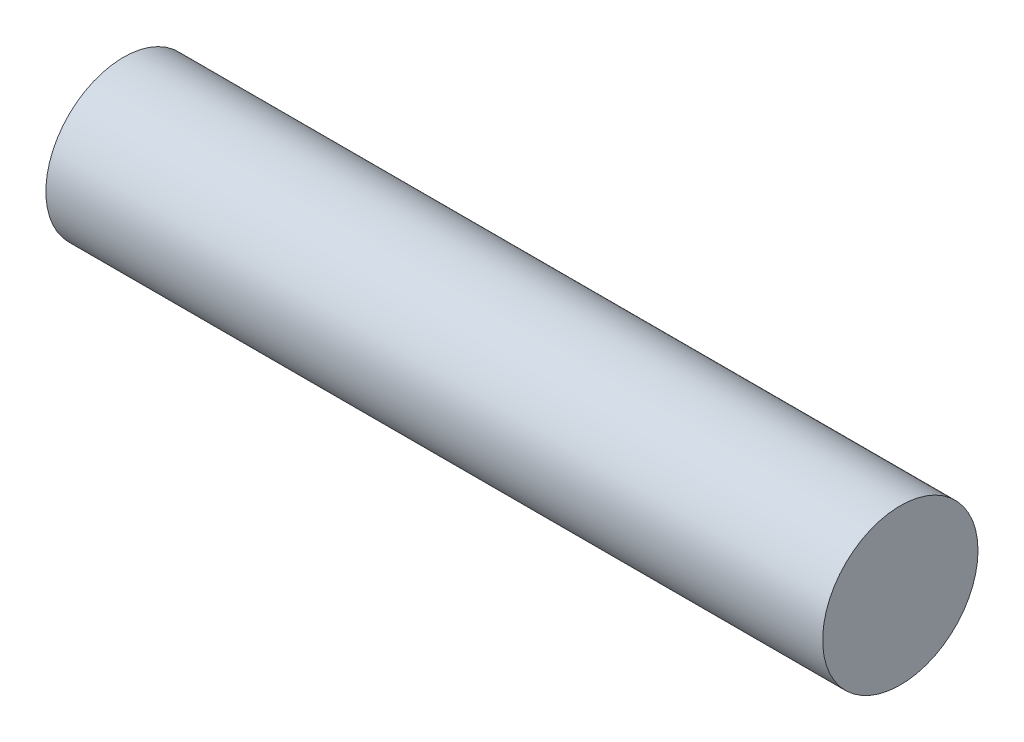
ISO-10303-21;
HEADER;
FILE_DESCRIPTION(('STEP AP214'),'2;1');
FILE_NAME('part.step','',(''),(''),'','','');
FILE_SCHEMA(('AUTOMOTIVE_DESIGN { 1 0 10303 214 1 1 1 1 }'));
ENDSEC;
DATA;
#1=APPLICATION_CONTEXT('core data for automotive mechanical design processes');
#2=APPLICATION_PROTOCOL_DEFINITION('international standard','automotive_design',2000,#1);
#3=PRODUCT_CONTEXT('',#1,'mechanical');
#4=PRODUCT('Part','Part','',(#3));
#5=PRODUCT_RELATED_PRODUCT_CATEGORY('part','',(#4));
#6=PRODUCT_DEFINITION_FORMATION('','',#4);
#7=PRODUCT_DEFINITION_CONTEXT('part definition',#1,'design');
#8=PRODUCT_DEFINITION('design','',#6,#7);
#9=PRODUCT_DEFINITION_SHAPE('','',#8);
#10=(LENGTH_UNIT() NAMED_UNIT(*) SI_UNIT(.MILLI.,.METRE.));
#11=(NAMED_UNIT(*) PLANE_ANGLE_UNIT() SI_UNIT($,.RADIAN.));
#12=(NAMED_UNIT(*) SI_UNIT($,.STERADIAN.) SOLID_ANGLE_UNIT());
#13=UNCERTAINTY_MEASURE_WITH_UNIT(LENGTH_MEASURE(1.E-05),#10,'distance_accuracy_value','');
#14=(GEOMETRIC_REPRESENTATION_CONTEXT(3) GLOBAL_UNCERTAINTY_ASSIGNED_CONTEXT((#13)) GLOBAL_UNIT_ASSIGNED_CONTEXT((#10,
#11,#12)) REPRESENTATION_CONTEXT('',''));
#15=CARTESIAN_POINT('',(0.,0.,0.));
#16=DIRECTION('',(0.,0.,1.));
#17=DIRECTION('',(1.,0.,0.));
#18=AXIS2_PLACEMENT_3D('',#15,#16,#17);
#19=CARTESIAN_POINT('',(10.,0.,0.));
#20=DIRECTION('',(-1.,0.,0.));
#21=DIRECTION('',(0.,0.,1.));
#22=AXIS2_PLACEMENT_3D('',#19,#20,#21);
#23=CYLINDRICAL_SURFACE('',#22,1.);
#24=CARTESIAN_POINT('',(10.,0.,0.));
#25=DIRECTION('',(1.,0.,0.));
#26=DIRECTION('',(0.,0.,-1.));
#27=AXIS2_PLACEMENT_3D('',#24,#25,#26);
#28=CIRCLE('',#27,1.);
#29=CARTESIAN_POINT('',(10.,0.,-1.));
#30=VERTEX_POINT('',#29);
#31=EDGE_CURVE('E10',#30,#30,#28,.T.);
#32=ORIENTED_EDGE('',*,*,#31,.F.);
#33=EDGE_LOOP('',(#32));
#34=FACE_BOUND('',#33,.T.);
#35=CARTESIAN_POINT('',(0.,0.,0.));
#36=DIRECTION('',(1.,0.,0.));
#37=DIRECTION('',(0.,0.,-1.));
#38=AXIS2_PLACEMENT_3D('',#35,#36,#37);
#39=CIRCLE('',#38,1.);
#40=CARTESIAN_POINT('',(0.,0.,-1.));
#41=VERTEX_POINT('',#40);
#42=EDGE_CURVE('E34',#41,#41,#39,.T.);
#43=ORIENTED_EDGE('',*,*,#42,.T.);
#44=EDGE_LOOP('',(#43));
#45=FACE_BOUND('',#44,.T.);
#46=ADVANCED_FACE('F31',(#34,#45),#23,.T.);
#47=CARTESIAN_POINT('',(10.,0.,0.));
#48=DIRECTION('',(1.,0.,0.));
#49=DIRECTION('',(0.,0.,-1.));
#50=AXIS2_PLACEMENT_3D('',#47,#48,#49);
#51=PLANE('',#50);
#52=ORIENTED_EDGE('',*,*,#31,.T.);
#53=EDGE_LOOP('',(#52));
#54=FACE_BOUND('',#53,.T.);
#55=ADVANCED_FACE('F46',(#54),#51,.T.);
#56=CARTESIAN_POINT('',(0.,0.,0.));
#57=DIRECTION('',(1.,0.,0.));
#58=DIRECTION('',(0.,0.,-1.));
#59=AXIS2_PLACEMENT_3D('',#56,#57,#58);
#60=PLANE('',#59);
#61=ORIENTED_EDGE('',*,*,#42,.F.);
#62=EDGE_LOOP('',(#61));
#63=FACE_BOUND('',#62,.T.);
#64=ADVANCED_FACE('F44',(#63),#60,.F.);
#65=CLOSED_SHELL('',(#46,#55,#64));
#66=MANIFOLD_SOLID_BREP('B2',#65);
#67=ADVANCED_BREP_SHAPE_REPRESENTATION('',(#18,#66),#14);
#68=SHAPE_DEFINITION_REPRESENTATION(#9,#67);
ENDSEC;
END-ISO-10303-21;
